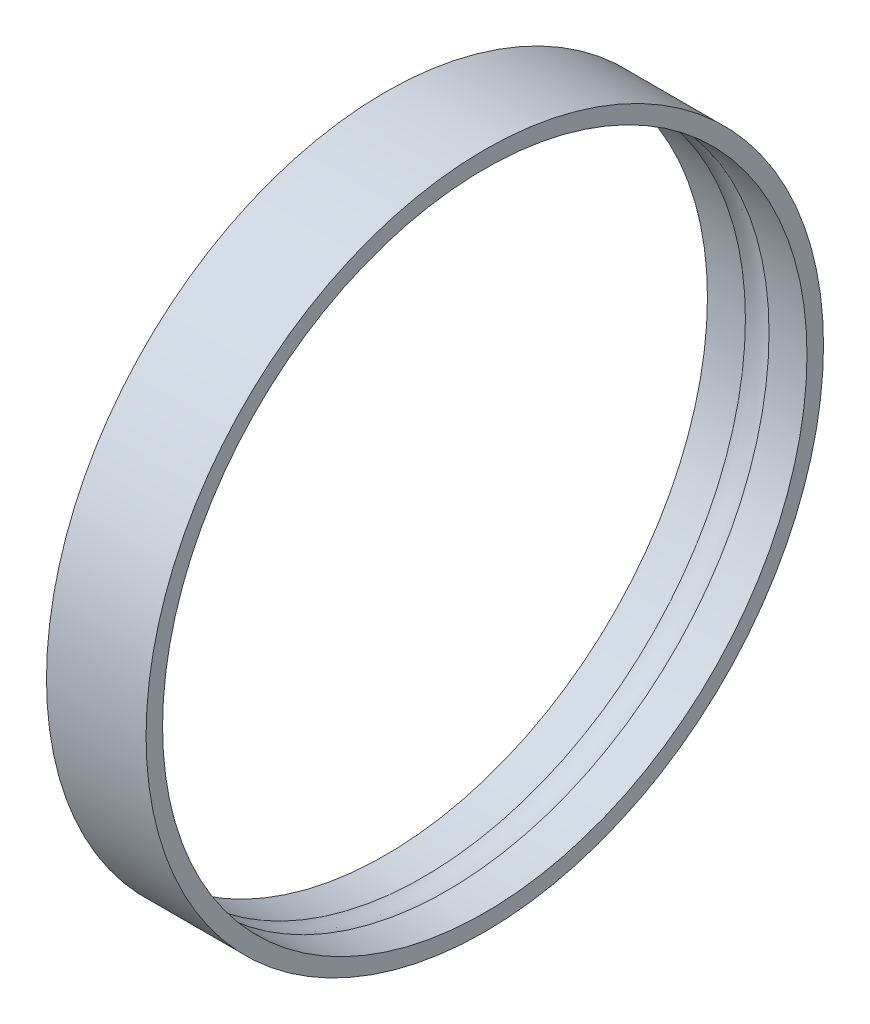
ISO-10303-21;
HEADER;
FILE_DESCRIPTION(('STEP AP214'),'2;1');
FILE_NAME('part.step','',(''),(''),'','','');
FILE_SCHEMA(('AUTOMOTIVE_DESIGN { 1 0 10303 214 1 1 1 1 }'));
ENDSEC;
DATA;
#1=APPLICATION_CONTEXT('core data for automotive mechanical design processes');
#2=APPLICATION_PROTOCOL_DEFINITION('international standard','automotive_design',2000,#1);
#3=PRODUCT_CONTEXT('',#1,'mechanical');
#4=PRODUCT('Part','Part','',(#3));
#5=PRODUCT_RELATED_PRODUCT_CATEGORY('part','',(#4));
#6=PRODUCT_DEFINITION_FORMATION('','',#4);
#7=PRODUCT_DEFINITION_CONTEXT('part definition',#1,'design');
#8=PRODUCT_DEFINITION('design','',#6,#7);
#9=PRODUCT_DEFINITION_SHAPE('','',#8);
#10=(LENGTH_UNIT() NAMED_UNIT(*) SI_UNIT(.MILLI.,.METRE.));
#11=(NAMED_UNIT(*) PLANE_ANGLE_UNIT() SI_UNIT($,.RADIAN.));
#12=(NAMED_UNIT(*) SI_UNIT($,.STERADIAN.) SOLID_ANGLE_UNIT());
#13=UNCERTAINTY_MEASURE_WITH_UNIT(LENGTH_MEASURE(1.E-05),#10,'distance_accuracy_value','');
#14=(GEOMETRIC_REPRESENTATION_CONTEXT(3) GLOBAL_UNCERTAINTY_ASSIGNED_CONTEXT((#13)) GLOBAL_UNIT_ASSIGNED_CONTEXT((#10,
#11,#12)) REPRESENTATION_CONTEXT('',''));
#15=CARTESIAN_POINT('',(0.,0.,0.));
#16=DIRECTION('',(0.,0.,1.));
#17=DIRECTION('',(1.,0.,0.));
#18=AXIS2_PLACEMENT_3D('',#15,#16,#17);
#19=CARTESIAN_POINT('',(49.75,0.,0.));
#20=DIRECTION('',(1.,0.,0.));
#21=DIRECTION('',(0.,0.,-1.));
#22=AXIS2_PLACEMENT_3D('',#19,#20,#21);
#23=TOROIDAL_SURFACE('',#22,52.9995,5.95);
#24=CARTESIAN_POINT('',(47.6039455389017,0.,0.));
#25=DIRECTION('',(-1.,0.,0.));
#26=DIRECTION('',(0.,0.,1.));
#27=AXIS2_PLACEMENT_3D('',#24,#25,#26);
#28=CIRCLE('',#27,58.549);
#29=CARTESIAN_POINT('',(47.6039455389017,0.,58.549));
#30=VERTEX_POINT('',#29);
#31=EDGE_CURVE('E31',#30,#30,#28,.T.);
#32=ORIENTED_EDGE('',*,*,#31,.T.);
#33=EDGE_LOOP('',(#32));
#34=FACE_BOUND('',#33,.T.);
#35=CARTESIAN_POINT('',(51.8960544610983,0.,0.));
#36=DIRECTION('',(-1.,0.,0.));
#37=DIRECTION('',(0.,0.,1.));
#38=AXIS2_PLACEMENT_3D('',#35,#36,#37);
#39=CIRCLE('',#38,58.549);
#40=CARTESIAN_POINT('',(51.8960544610983,0.,58.549));
#41=VERTEX_POINT('',#40);
#42=EDGE_CURVE('E36',#41,#41,#39,.F.);
#43=ORIENTED_EDGE('',*,*,#42,.T.);
#44=EDGE_LOOP('',(#43));
#45=FACE_BOUND('',#44,.T.);
#46=ADVANCED_FACE('F15',(#34,#45),#23,.F.);
#47=CARTESIAN_POINT('',(49.75,0.,0.));
#48=DIRECTION('',(-1.,0.,0.));
#49=DIRECTION('',(0.,0.,1.));
#50=AXIS2_PLACEMENT_3D('',#47,#48,#49);
#51=CYLINDRICAL_SURFACE('',#50,58.549);
#52=CARTESIAN_POINT('',(40.705,0.,0.));
#53=DIRECTION('',(-1.,0.,0.));
#54=DIRECTION('',(0.,0.,1.));
#55=AXIS2_PLACEMENT_3D('',#52,#53,#54);
#56=CIRCLE('',#55,58.549);
#57=CARTESIAN_POINT('',(40.705,0.,58.549));
#58=VERTEX_POINT('',#57);
#59=EDGE_CURVE('E19',#58,#58,#56,.F.);
#60=ORIENTED_EDGE('',*,*,#59,.F.);
#61=EDGE_LOOP('',(#60));
#62=FACE_BOUND('',#61,.T.);
#63=ORIENTED_EDGE('',*,*,#31,.F.);
#64=EDGE_LOOP('',(#63));
#65=FACE_BOUND('',#64,.T.);
#66=ADVANCED_FACE('F48',(#62,#65),#51,.F.);
#67=CARTESIAN_POINT('',(49.75,0.,0.));
#68=DIRECTION('',(-1.,0.,0.));
#69=DIRECTION('',(0.,0.,1.));
#70=AXIS2_PLACEMENT_3D('',#67,#68,#69);
#71=CYLINDRICAL_SURFACE('',#70,58.549);
#72=ORIENTED_EDGE('',*,*,#42,.F.);
#73=EDGE_LOOP('',(#72));
#74=FACE_BOUND('',#73,.T.);
#75=CARTESIAN_POINT('',(58.795,0.,0.));
#76=DIRECTION('',(-1.,0.,0.));
#77=DIRECTION('',(0.,0.,1.));
#78=AXIS2_PLACEMENT_3D('',#75,#76,#77);
#79=CIRCLE('',#78,58.549);
#80=CARTESIAN_POINT('',(58.795,0.,58.549));
#81=VERTEX_POINT('',#80);
#82=EDGE_CURVE('E28',#81,#81,#79,.T.);
#83=ORIENTED_EDGE('',*,*,#82,.F.);
#84=EDGE_LOOP('',(#83));
#85=FACE_BOUND('',#84,.T.);
#86=ADVANCED_FACE('F50',(#74,#85),#71,.F.);
#87=CARTESIAN_POINT('',(40.705,0.,60.049));
#88=DIRECTION('',(-1.,0.,0.));
#89=DIRECTION('',(0.,0.,1.));
#90=AXIS2_PLACEMENT_3D('',#87,#88,#89);
#91=PLANE('',#90);
#92=ORIENTED_EDGE('',*,*,#59,.T.);
#93=EDGE_LOOP('',(#92));
#94=FACE_BOUND('',#93,.T.);
#95=CARTESIAN_POINT('',(40.705,0.,0.));
#96=DIRECTION('',(-1.,0.,0.));
#97=DIRECTION('',(0.,0.,1.));
#98=AXIS2_PLACEMENT_3D('',#95,#96,#97);
#99=CIRCLE('',#98,61.549);
#100=CARTESIAN_POINT('',(40.705,0.,61.549));
#101=VERTEX_POINT('',#100);
#102=EDGE_CURVE('E23',#101,#101,#99,.F.);
#103=ORIENTED_EDGE('',*,*,#102,.F.);
#104=EDGE_LOOP('',(#103));
#105=FACE_BOUND('',#104,.T.);
#106=ADVANCED_FACE('F57',(#94,#105),#91,.T.);
#107=CARTESIAN_POINT('',(58.795,0.,60.049));
#108=DIRECTION('',(1.,0.,0.));
#109=DIRECTION('',(0.,0.,-1.));
#110=AXIS2_PLACEMENT_3D('',#107,#108,#109);
#111=PLANE('',#110);
#112=CARTESIAN_POINT('',(58.795,0.,0.));
#113=DIRECTION('',(-1.,0.,0.));
#114=DIRECTION('',(0.,0.,1.));
#115=AXIS2_PLACEMENT_3D('',#112,#113,#114);
#116=CIRCLE('',#115,61.549);
#117=CARTESIAN_POINT('',(58.795,0.,61.549));
#118=VERTEX_POINT('',#117);
#119=EDGE_CURVE('E10',#118,#118,#116,.T.);
#120=ORIENTED_EDGE('',*,*,#119,.F.);
#121=EDGE_LOOP('',(#120));
#122=FACE_BOUND('',#121,.T.);
#123=ORIENTED_EDGE('',*,*,#82,.T.);
#124=EDGE_LOOP('',(#123));
#125=FACE_BOUND('',#124,.T.);
#126=ADVANCED_FACE('F62',(#122,#125),#111,.T.);
#127=CARTESIAN_POINT('',(49.75,0.,0.));
#128=DIRECTION('',(-1.,0.,0.));
#129=DIRECTION('',(0.,0.,1.));
#130=AXIS2_PLACEMENT_3D('',#127,#128,#129);
#131=CYLINDRICAL_SURFACE('',#130,61.549);
#132=ORIENTED_EDGE('',*,*,#102,.T.);
#133=EDGE_LOOP('',(#132));
#134=FACE_BOUND('',#133,.T.);
#135=ORIENTED_EDGE('',*,*,#119,.T.);
#136=EDGE_LOOP('',(#135));
#137=FACE_BOUND('',#136,.T.);
#138=ADVANCED_FACE('F60',(#134,#137),#131,.T.);
#139=CLOSED_SHELL('',(#46,#66,#86,#106,#126,#138));
#140=MANIFOLD_SOLID_BREP('B1',#139);
#141=ADVANCED_BREP_SHAPE_REPRESENTATION('',(#18,#140),#14);
#142=SHAPE_DEFINITION_REPRESENTATION(#9,#141);
ENDSEC;
END-ISO-10303-21;
